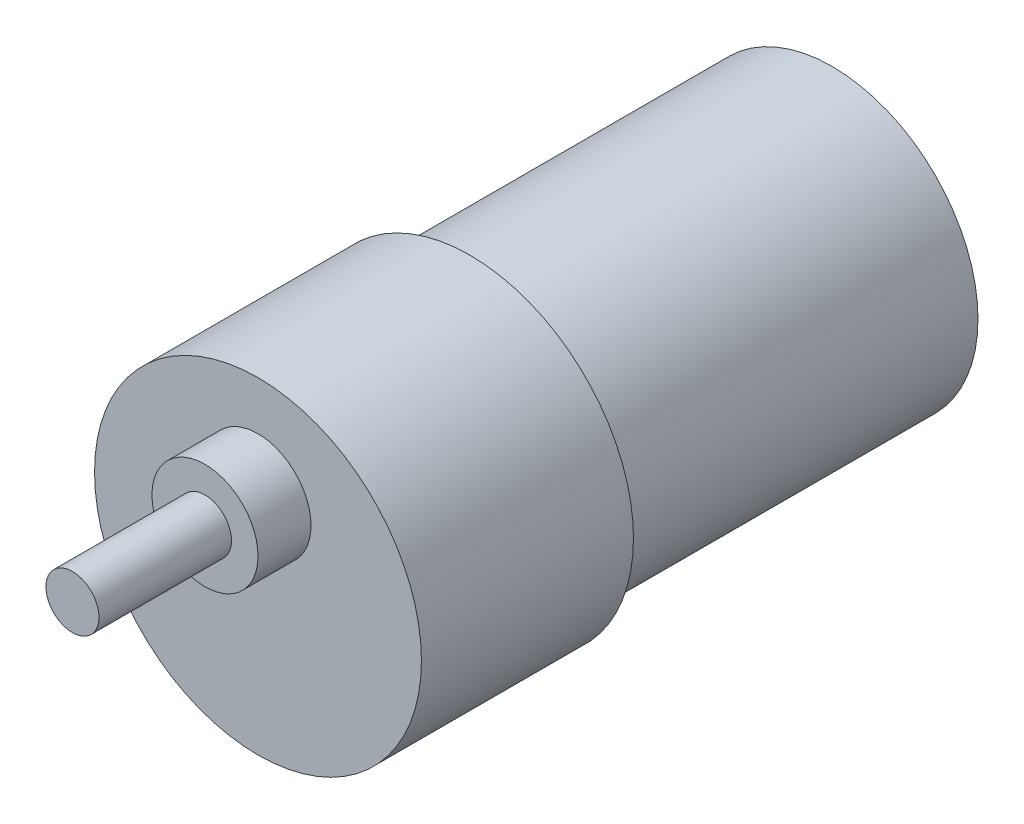
ISO-10303-21;
HEADER;
FILE_DESCRIPTION(('STEP AP214'),'2;1');
FILE_NAME('part.step','',(''),(''),'','','');
FILE_SCHEMA(('AUTOMOTIVE_DESIGN { 1 0 10303 214 1 1 1 1 }'));
ENDSEC;
DATA;
#1=APPLICATION_CONTEXT('core data for automotive mechanical design processes');
#2=APPLICATION_PROTOCOL_DEFINITION('international standard','automotive_design',2000,#1);
#3=PRODUCT_CONTEXT('',#1,'mechanical');
#4=PRODUCT('Part','Part','',(#3));
#5=PRODUCT_RELATED_PRODUCT_CATEGORY('part','',(#4));
#6=PRODUCT_DEFINITION_FORMATION('','',#4);
#7=PRODUCT_DEFINITION_CONTEXT('part definition',#1,'design');
#8=PRODUCT_DEFINITION('design','',#6,#7);
#9=PRODUCT_DEFINITION_SHAPE('','',#8);
#10=(LENGTH_UNIT() NAMED_UNIT(*) SI_UNIT(.MILLI.,.METRE.));
#11=(NAMED_UNIT(*) PLANE_ANGLE_UNIT() SI_UNIT($,.RADIAN.));
#12=(NAMED_UNIT(*) SI_UNIT($,.STERADIAN.) SOLID_ANGLE_UNIT());
#13=UNCERTAINTY_MEASURE_WITH_UNIT(LENGTH_MEASURE(1.E-05),#10,'distance_accuracy_value','');
#14=(GEOMETRIC_REPRESENTATION_CONTEXT(3) GLOBAL_UNCERTAINTY_ASSIGNED_CONTEXT((#13)) GLOBAL_UNIT_ASSIGNED_CONTEXT((#10,
#11,#12)) REPRESENTATION_CONTEXT('',''));
#15=CARTESIAN_POINT('',(0.,0.,0.));
#16=DIRECTION('',(0.,0.,1.));
#17=DIRECTION('',(1.,0.,0.));
#18=AXIS2_PLACEMENT_3D('',#15,#16,#17);
#19=CARTESIAN_POINT('',(0.,0.,20.5));
#20=DIRECTION('',(0.,0.,-1.));
#21=DIRECTION('',(-1.,0.,0.));
#22=AXIS2_PLACEMENT_3D('',#19,#20,#21);
#23=CYLINDRICAL_SURFACE('',#22,16.5);
#24=CARTESIAN_POINT('',(0.,0.,20.5));
#25=DIRECTION('',(0.,0.,1.));
#26=DIRECTION('',(1.,0.,0.));
#27=AXIS2_PLACEMENT_3D('',#24,#25,#26);
#28=CIRCLE('',#27,16.5);
#29=CARTESIAN_POINT('',(16.5,0.,20.5));
#30=VERTEX_POINT('',#29);
#31=EDGE_CURVE('E51',#30,#30,#28,.T.);
#32=ORIENTED_EDGE('',*,*,#31,.F.);
#33=EDGE_LOOP('',(#32));
#34=FACE_BOUND('',#33,.T.);
#35=CARTESIAN_POINT('',(0.,0.,-20.5));
#36=DIRECTION('',(0.,0.,1.));
#37=DIRECTION('',(1.,0.,0.));
#38=AXIS2_PLACEMENT_3D('',#35,#36,#37);
#39=CIRCLE('',#38,16.5);
#40=CARTESIAN_POINT('',(16.5,0.,-20.5));
#41=VERTEX_POINT('',#40);
#42=EDGE_CURVE('E46',#41,#41,#39,.T.);
#43=ORIENTED_EDGE('',*,*,#42,.T.);
#44=EDGE_LOOP('',(#43));
#45=FACE_BOUND('',#44,.T.);
#46=ADVANCED_FACE('F43',(#34,#45),#23,.T.);
#47=CARTESIAN_POINT('',(0.,0.,-20.5));
#48=DIRECTION('',(0.,0.,1.));
#49=DIRECTION('',(1.,0.,0.));
#50=AXIS2_PLACEMENT_3D('',#47,#48,#49);
#51=PLANE('',#50);
#52=ORIENTED_EDGE('',*,*,#42,.F.);
#53=EDGE_LOOP('',(#52));
#54=FACE_BOUND('',#53,.T.);
#55=ADVANCED_FACE('F97',(#54),#51,.F.);
#56=CARTESIAN_POINT('',(0.,0.,44.5));
#57=DIRECTION('',(0.,0.,-1.));
#58=DIRECTION('',(-1.,0.,0.));
#59=AXIS2_PLACEMENT_3D('',#56,#57,#58);
#60=CYLINDRICAL_SURFACE('',#59,18.5);
#61=CARTESIAN_POINT('',(0.,0.,44.5));
#62=DIRECTION('',(0.,0.,1.));
#63=DIRECTION('',(1.,0.,0.));
#64=AXIS2_PLACEMENT_3D('',#61,#62,#63);
#65=CIRCLE('',#64,18.5);
#66=CARTESIAN_POINT('',(18.5,0.,44.5));
#67=VERTEX_POINT('',#66);
#68=EDGE_CURVE('E69',#67,#67,#65,.T.);
#69=ORIENTED_EDGE('',*,*,#68,.F.);
#70=EDGE_LOOP('',(#69));
#71=FACE_BOUND('',#70,.T.);
#72=CARTESIAN_POINT('',(0.,0.,20.5));
#73=DIRECTION('',(0.,0.,1.));
#74=DIRECTION('',(1.,0.,0.));
#75=AXIS2_PLACEMENT_3D('',#72,#73,#74);
#76=CIRCLE('',#75,18.5);
#77=CARTESIAN_POINT('',(18.5,0.,20.5));
#78=VERTEX_POINT('',#77);
#79=EDGE_CURVE('E64',#78,#78,#76,.T.);
#80=ORIENTED_EDGE('',*,*,#79,.T.);
#81=EDGE_LOOP('',(#80));
#82=FACE_BOUND('',#81,.T.);
#83=ADVANCED_FACE('F77',(#71,#82),#60,.T.);
#84=CARTESIAN_POINT('',(0.,0.,44.5));
#85=DIRECTION('',(0.,0.,1.));
#86=DIRECTION('',(1.,0.,0.));
#87=AXIS2_PLACEMENT_3D('',#84,#85,#86);
#88=PLANE('',#87);
#89=CARTESIAN_POINT('',(0.,7.,44.5));
#90=DIRECTION('',(0.,0.,1.));
#91=DIRECTION('',(1.,0.,0.));
#92=AXIS2_PLACEMENT_3D('',#89,#90,#91);
#93=CIRCLE('',#92,6.);
#94=CARTESIAN_POINT('',(6.,7.,44.5));
#95=VERTEX_POINT('',#94);
#96=EDGE_CURVE('E65',#95,#95,#93,.T.);
#97=ORIENTED_EDGE('',*,*,#96,.F.);
#98=EDGE_LOOP('',(#97));
#99=FACE_BOUND('',#98,.T.);
#100=ORIENTED_EDGE('',*,*,#68,.T.);
#101=EDGE_LOOP('',(#100));
#102=FACE_BOUND('',#101,.T.);
#103=ADVANCED_FACE('F82',(#99,#102),#88,.T.);
#104=CARTESIAN_POINT('',(0.,0.,20.5));
#105=DIRECTION('',(0.,0.,1.));
#106=DIRECTION('',(1.,0.,0.));
#107=AXIS2_PLACEMENT_3D('',#104,#105,#106);
#108=PLANE('',#107);
#109=ORIENTED_EDGE('',*,*,#31,.T.);
#110=EDGE_LOOP('',(#109));
#111=FACE_BOUND('',#110,.T.);
#112=ORIENTED_EDGE('',*,*,#79,.F.);
#113=EDGE_LOOP('',(#112));
#114=FACE_BOUND('',#113,.T.);
#115=ADVANCED_FACE('F79',(#111,#114),#108,.F.);
#116=CARTESIAN_POINT('',(0.,7.,50.5));
#117=DIRECTION('',(0.,0.,-1.));
#118=DIRECTION('',(-1.,0.,0.));
#119=AXIS2_PLACEMENT_3D('',#116,#117,#118);
#120=CYLINDRICAL_SURFACE('',#119,6.);
#121=CARTESIAN_POINT('',(0.,7.,50.5));
#122=DIRECTION('',(0.,0.,1.));
#123=DIRECTION('',(1.,0.,0.));
#124=AXIS2_PLACEMENT_3D('',#121,#122,#123);
#125=CIRCLE('',#124,6.);
#126=CARTESIAN_POINT('',(6.,7.,50.5));
#127=VERTEX_POINT('',#126);
#128=EDGE_CURVE('E60',#127,#127,#125,.T.);
#129=ORIENTED_EDGE('',*,*,#128,.F.);
#130=EDGE_LOOP('',(#129));
#131=FACE_BOUND('',#130,.T.);
#132=ORIENTED_EDGE('',*,*,#96,.T.);
#133=EDGE_LOOP('',(#132));
#134=FACE_BOUND('',#133,.T.);
#135=ADVANCED_FACE('F81',(#131,#134),#120,.T.);
#136=CARTESIAN_POINT('',(0.,7.,50.5));
#137=DIRECTION('',(0.,0.,1.));
#138=DIRECTION('',(1.,0.,0.));
#139=AXIS2_PLACEMENT_3D('',#136,#137,#138);
#140=PLANE('',#139);
#141=CARTESIAN_POINT('',(0.,7.,50.5));
#142=DIRECTION('',(0.,0.,1.));
#143=DIRECTION('',(1.,0.,0.));
#144=AXIS2_PLACEMENT_3D('',#141,#142,#143);
#145=CIRCLE('',#144,3.);
#146=CARTESIAN_POINT('',(3.,7.,50.5));
#147=VERTEX_POINT('',#146);
#148=EDGE_CURVE('E10',#147,#147,#145,.T.);
#149=ORIENTED_EDGE('',*,*,#148,.F.);
#150=EDGE_LOOP('',(#149));
#151=FACE_BOUND('',#150,.T.);
#152=ORIENTED_EDGE('',*,*,#128,.T.);
#153=EDGE_LOOP('',(#152));
#154=FACE_BOUND('',#153,.T.);
#155=ADVANCED_FACE('F90',(#151,#154),#140,.T.);
#156=CARTESIAN_POINT('',(0.,7.,65.5));
#157=DIRECTION('',(0.,0.,-1.));
#158=DIRECTION('',(-1.,0.,0.));
#159=AXIS2_PLACEMENT_3D('',#156,#157,#158);
#160=CYLINDRICAL_SURFACE('',#159,3.);
#161=CARTESIAN_POINT('',(0.,7.,65.5));
#162=DIRECTION('',(0.,0.,1.));
#163=DIRECTION('',(1.,0.,0.));
#164=AXIS2_PLACEMENT_3D('',#161,#162,#163);
#165=CIRCLE('',#164,3.);
#166=CARTESIAN_POINT('',(3.,7.,65.5));
#167=VERTEX_POINT('',#166);
#168=EDGE_CURVE('E59',#167,#167,#165,.T.);
#169=ORIENTED_EDGE('',*,*,#168,.F.);
#170=EDGE_LOOP('',(#169));
#171=FACE_BOUND('',#170,.T.);
#172=ORIENTED_EDGE('',*,*,#148,.T.);
#173=EDGE_LOOP('',(#172));
#174=FACE_BOUND('',#173,.T.);
#175=ADVANCED_FACE('F144',(#171,#174),#160,.T.);
#176=CARTESIAN_POINT('',(0.,7.,65.5));
#177=DIRECTION('',(0.,0.,1.));
#178=DIRECTION('',(1.,0.,0.));
#179=AXIS2_PLACEMENT_3D('',#176,#177,#178);
#180=PLANE('',#179);
#181=ORIENTED_EDGE('',*,*,#168,.T.);
#182=EDGE_LOOP('',(#181));
#183=FACE_BOUND('',#182,.T.);
#184=ADVANCED_FACE('F154',(#183),#180,.T.);
#185=CLOSED_SHELL('',(#46,#55,#83,#103,#115,#135,#155,#175,#184));
#186=MANIFOLD_SOLID_BREP('B2',#185);
#187=ADVANCED_BREP_SHAPE_REPRESENTATION('',(#18,#186),#14);
#188=SHAPE_DEFINITION_REPRESENTATION(#9,#187);
ENDSEC;
END-ISO-10303-21;
